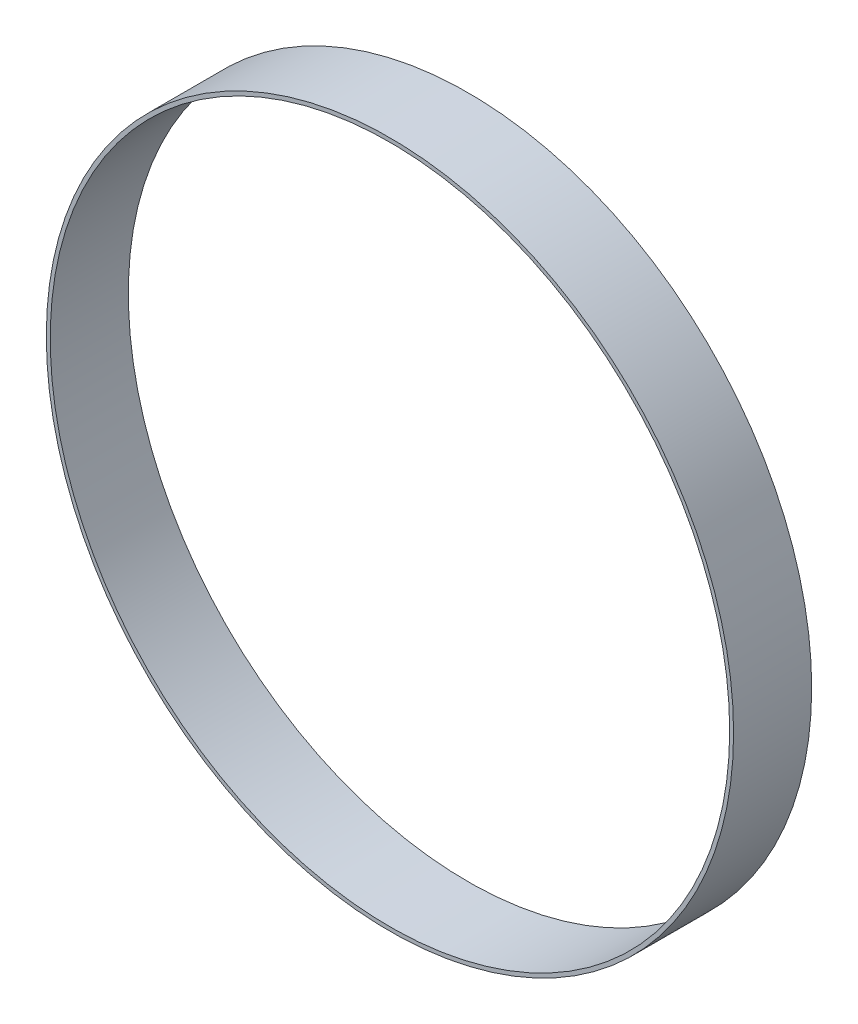
ISO-10303-21;
HEADER;
FILE_DESCRIPTION(('STEP AP214'),'2;1');
FILE_NAME('part.step','',(''),(''),'','','');
FILE_SCHEMA(('AUTOMOTIVE_DESIGN { 1 0 10303 214 1 1 1 1 }'));
ENDSEC;
DATA;
#1=APPLICATION_CONTEXT('core data for automotive mechanical design processes');
#2=APPLICATION_PROTOCOL_DEFINITION('international standard','automotive_design',2000,#1);
#3=PRODUCT_CONTEXT('',#1,'mechanical');
#4=PRODUCT('Part','Part','',(#3));
#5=PRODUCT_RELATED_PRODUCT_CATEGORY('part','',(#4));
#6=PRODUCT_DEFINITION_FORMATION('','',#4);
#7=PRODUCT_DEFINITION_CONTEXT('part definition',#1,'design');
#8=PRODUCT_DEFINITION('design','',#6,#7);
#9=PRODUCT_DEFINITION_SHAPE('','',#8);
#10=(LENGTH_UNIT() NAMED_UNIT(*) SI_UNIT(.MILLI.,.METRE.));
#11=(NAMED_UNIT(*) PLANE_ANGLE_UNIT() SI_UNIT($,.RADIAN.));
#12=(NAMED_UNIT(*) SI_UNIT($,.STERADIAN.) SOLID_ANGLE_UNIT());
#13=UNCERTAINTY_MEASURE_WITH_UNIT(LENGTH_MEASURE(1.E-05),#10,'distance_accuracy_value','');
#14=(GEOMETRIC_REPRESENTATION_CONTEXT(3) GLOBAL_UNCERTAINTY_ASSIGNED_CONTEXT((#13)) GLOBAL_UNIT_ASSIGNED_CONTEXT((#10,
#11,#12)) REPRESENTATION_CONTEXT('',''));
#15=CARTESIAN_POINT('',(0.,0.,0.));
#16=DIRECTION('',(0.,0.,1.));
#17=DIRECTION('',(1.,0.,0.));
#18=AXIS2_PLACEMENT_3D('',#15,#16,#17);
#19=CARTESIAN_POINT('',(0.,0.,0.));
#20=DIRECTION('',(0.,0.,1.));
#21=DIRECTION('',(1.,0.,0.));
#22=AXIS2_PLACEMENT_3D('',#19,#20,#21);
#23=PLANE('',#22);
#24=CARTESIAN_POINT('',(0.,0.,0.));
#25=DIRECTION('',(0.,0.,1.));
#26=DIRECTION('',(1.,0.,0.));
#27=AXIS2_PLACEMENT_3D('',#24,#25,#26);
#28=CIRCLE('',#27,22.098);
#29=CARTESIAN_POINT('',(22.098,0.,0.));
#30=VERTEX_POINT('',#29);
#31=EDGE_CURVE('E40',#30,#30,#28,.T.);
#32=ORIENTED_EDGE('',*,*,#31,.T.);
#33=EDGE_LOOP('',(#32));
#34=FACE_BOUND('',#33,.T.);
#35=CARTESIAN_POINT('',(0.,0.,0.));
#36=DIRECTION('',(0.,0.,-1.));
#37=DIRECTION('',(-1.,0.,0.));
#38=AXIS2_PLACEMENT_3D('',#35,#36,#37);
#39=CIRCLE('',#38,22.352);
#40=CARTESIAN_POINT('',(-22.352,0.,0.));
#41=VERTEX_POINT('',#40);
#42=EDGE_CURVE('E33',#41,#41,#39,.F.);
#43=ORIENTED_EDGE('',*,*,#42,.F.);
#44=EDGE_LOOP('',(#43));
#45=FACE_BOUND('',#44,.T.);
#46=ADVANCED_FACE('F30',(#34,#45),#23,.F.);
#47=CARTESIAN_POINT('',(0.,0.,5.08));
#48=DIRECTION('',(0.,0.,-1.));
#49=DIRECTION('',(-1.,0.,0.));
#50=AXIS2_PLACEMENT_3D('',#47,#48,#49);
#51=CYLINDRICAL_SURFACE('',#50,22.352);
#52=ORIENTED_EDGE('',*,*,#42,.T.);
#53=EDGE_LOOP('',(#52));
#54=FACE_BOUND('',#53,.T.);
#55=CARTESIAN_POINT('',(0.,0.,5.08));
#56=DIRECTION('',(0.,0.,-1.));
#57=DIRECTION('',(-1.,0.,0.));
#58=AXIS2_PLACEMENT_3D('',#55,#56,#57);
#59=CIRCLE('',#58,22.352);
#60=CARTESIAN_POINT('',(-22.352,0.,5.08));
#61=VERTEX_POINT('',#60);
#62=EDGE_CURVE('E10',#61,#61,#59,.F.);
#63=ORIENTED_EDGE('',*,*,#62,.F.);
#64=EDGE_LOOP('',(#63));
#65=FACE_BOUND('',#64,.T.);
#66=ADVANCED_FACE('F58',(#54,#65),#51,.T.);
#67=CARTESIAN_POINT('',(0.,0.,5.08));
#68=DIRECTION('',(0.,0.,1.));
#69=DIRECTION('',(1.,0.,0.));
#70=AXIS2_PLACEMENT_3D('',#67,#68,#69);
#71=PLANE('',#70);
#72=CARTESIAN_POINT('',(0.,0.,5.08));
#73=DIRECTION('',(0.,0.,1.));
#74=DIRECTION('',(1.,0.,0.));
#75=AXIS2_PLACEMENT_3D('',#72,#73,#74);
#76=CIRCLE('',#75,22.098);
#77=CARTESIAN_POINT('',(22.098,0.,5.08));
#78=VERTEX_POINT('',#77);
#79=EDGE_CURVE('E42',#78,#78,#76,.T.);
#80=ORIENTED_EDGE('',*,*,#79,.F.);
#81=EDGE_LOOP('',(#80));
#82=FACE_BOUND('',#81,.T.);
#83=ORIENTED_EDGE('',*,*,#62,.T.);
#84=EDGE_LOOP('',(#83));
#85=FACE_BOUND('',#84,.T.);
#86=ADVANCED_FACE('F53',(#82,#85),#71,.T.);
#87=CARTESIAN_POINT('',(0.,0.,0.));
#88=DIRECTION('',(0.,0.,1.));
#89=DIRECTION('',(1.,0.,0.));
#90=AXIS2_PLACEMENT_3D('',#87,#88,#89);
#91=CYLINDRICAL_SURFACE('',#90,22.098);
#92=ORIENTED_EDGE('',*,*,#31,.F.);
#93=EDGE_LOOP('',(#92));
#94=FACE_BOUND('',#93,.T.);
#95=ORIENTED_EDGE('',*,*,#79,.T.);
#96=EDGE_LOOP('',(#95));
#97=FACE_BOUND('',#96,.T.);
#98=ADVANCED_FACE('F50',(#94,#97),#91,.F.);
#99=CLOSED_SHELL('',(#46,#66,#86,#98));
#100=MANIFOLD_SOLID_BREP('B2',#99);
#101=ADVANCED_BREP_SHAPE_REPRESENTATION('',(#18,#100),#14);
#102=SHAPE_DEFINITION_REPRESENTATION(#9,#101);
ENDSEC;
END-ISO-10303-21;
